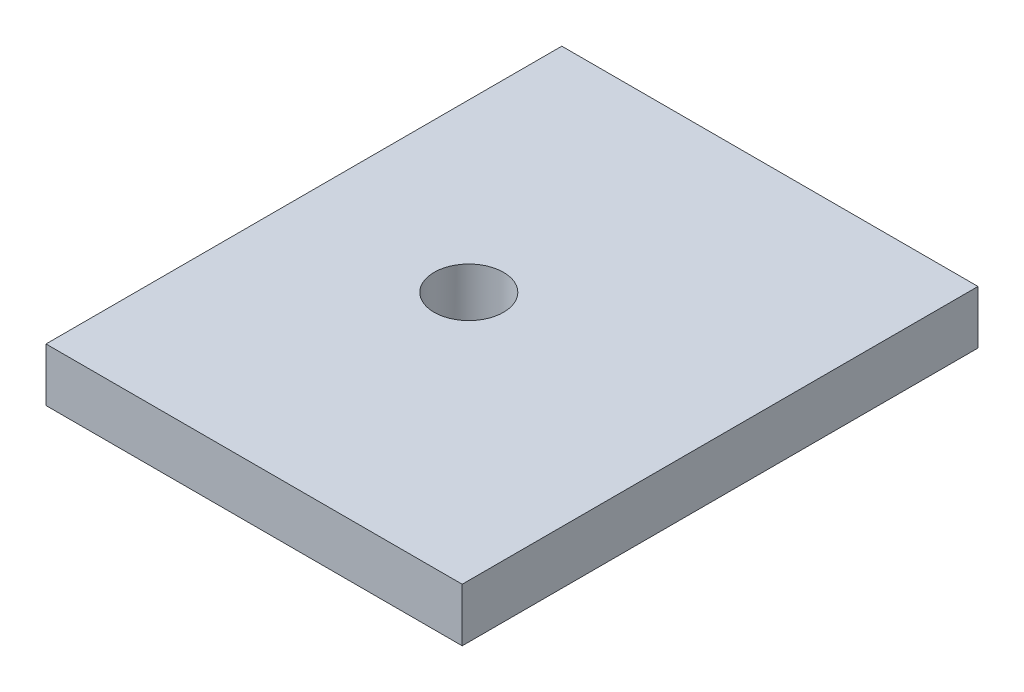
ISO-10303-21;
HEADER;
FILE_DESCRIPTION(('STEP AP214'),'2;1');
FILE_NAME('part.step','',(''),(''),'','','');
FILE_SCHEMA(('AUTOMOTIVE_DESIGN { 1 0 10303 214 1 1 1 1 }'));
ENDSEC;
DATA;
#1=APPLICATION_CONTEXT('core data for automotive mechanical design processes');
#2=APPLICATION_PROTOCOL_DEFINITION('international standard','automotive_design',2000,#1);
#3=PRODUCT_CONTEXT('',#1,'mechanical');
#4=PRODUCT('Part','Part','',(#3));
#5=PRODUCT_RELATED_PRODUCT_CATEGORY('part','',(#4));
#6=PRODUCT_DEFINITION_FORMATION('','',#4);
#7=PRODUCT_DEFINITION_CONTEXT('part definition',#1,'design');
#8=PRODUCT_DEFINITION('design','',#6,#7);
#9=PRODUCT_DEFINITION_SHAPE('','',#8);
#10=(LENGTH_UNIT() NAMED_UNIT(*) SI_UNIT(.MILLI.,.METRE.));
#11=(NAMED_UNIT(*) PLANE_ANGLE_UNIT() SI_UNIT($,.RADIAN.));
#12=(NAMED_UNIT(*) SI_UNIT($,.STERADIAN.) SOLID_ANGLE_UNIT());
#13=UNCERTAINTY_MEASURE_WITH_UNIT(LENGTH_MEASURE(1.E-05),#10,'distance_accuracy_value','');
#14=(GEOMETRIC_REPRESENTATION_CONTEXT(3) GLOBAL_UNCERTAINTY_ASSIGNED_CONTEXT((#13)) GLOBAL_UNIT_ASSIGNED_CONTEXT((#10,
#11,#12)) REPRESENTATION_CONTEXT('',''));
#15=CARTESIAN_POINT('',(0.,0.,0.));
#16=DIRECTION('',(0.,0.,1.));
#17=DIRECTION('',(1.,0.,0.));
#18=AXIS2_PLACEMENT_3D('',#15,#16,#17);
#19=CARTESIAN_POINT('',(0.,3.,0.));
#20=DIRECTION('',(0.,-1.,0.));
#21=DIRECTION('',(0.,0.,-1.));
#22=AXIS2_PLACEMENT_3D('',#19,#20,#21);
#23=PLANE('',#22);
#24=CARTESIAN_POINT('',(-2.32817741662061,3.,0.100000000001585));
#25=DIRECTION('',(0.,1.,0.));
#26=DIRECTION('',(0.,0.,1.));
#27=AXIS2_PLACEMENT_3D('',#24,#25,#26);
#28=CIRCLE('',#27,1.95000000000004);
#29=CARTESIAN_POINT('',(-2.32817741662061,3.,2.05000000000162));
#30=VERTEX_POINT('',#29);
#31=EDGE_CURVE('E113',#30,#30,#28,.T.);
#32=ORIENTED_EDGE('',*,*,#31,.F.);
#33=EDGE_LOOP('',(#32));
#34=FACE_BOUND('',#33,.T.);
#35=DIRECTION('',(0.,0.,-1.));
#36=VECTOR('',#35,1.);
#37=CARTESIAN_POINT('',(11.7,3.,14.5));
#38=LINE('',#37,#36);
#39=CARTESIAN_POINT('',(11.7,3.,14.5));
#40=VERTEX_POINT('',#39);
#41=CARTESIAN_POINT('',(11.7,3.,-14.5));
#42=VERTEX_POINT('',#41);
#43=EDGE_CURVE('E87',#40,#42,#38,.T.);
#44=ORIENTED_EDGE('',*,*,#43,.T.);
#45=DIRECTION('',(-1.,0.,0.));
#46=VECTOR('',#45,1.);
#47=CARTESIAN_POINT('',(-11.7,3.,-14.5));
#48=LINE('',#47,#46);
#49=CARTESIAN_POINT('',(-11.7,3.,-14.5));
#50=VERTEX_POINT('',#49);
#51=EDGE_CURVE('E83',#42,#50,#48,.T.);
#52=ORIENTED_EDGE('',*,*,#51,.T.);
#53=DIRECTION('',(0.,0.,1.));
#54=VECTOR('',#53,1.);
#55=CARTESIAN_POINT('',(-11.7,3.,14.5));
#56=LINE('',#55,#54);
#57=CARTESIAN_POINT('',(-11.7,3.,14.5));
#58=VERTEX_POINT('',#57);
#59=EDGE_CURVE('E85',#50,#58,#56,.T.);
#60=ORIENTED_EDGE('',*,*,#59,.T.);
#61=DIRECTION('',(1.,0.,0.));
#62=VECTOR('',#61,1.);
#63=CARTESIAN_POINT('',(-11.7,3.,14.5));
#64=LINE('',#63,#62);
#65=EDGE_CURVE('E53',#58,#40,#64,.T.);
#66=ORIENTED_EDGE('',*,*,#65,.T.);
#67=EDGE_LOOP('',(#44,#52,#60,#66));
#68=FACE_BOUND('',#67,.T.);
#69=ADVANCED_FACE('F35',(#34,#68),#23,.F.);
#70=CARTESIAN_POINT('',(0.,0.,0.));
#71=DIRECTION('',(0.,-1.,0.));
#72=DIRECTION('',(0.,0.,-1.));
#73=AXIS2_PLACEMENT_3D('',#70,#71,#72);
#74=PLANE('',#73);
#75=CARTESIAN_POINT('',(-2.32817741662061,0.,0.100000000001585));
#76=DIRECTION('',(0.,-1.,0.));
#77=DIRECTION('',(0.,0.,-1.));
#78=AXIS2_PLACEMENT_3D('',#75,#76,#77);
#79=CIRCLE('',#78,1.95000000000004);
#80=CARTESIAN_POINT('',(-2.32817741662061,0.,-1.84999999999845));
#81=VERTEX_POINT('',#80);
#82=EDGE_CURVE('E39',#81,#81,#79,.T.);
#83=ORIENTED_EDGE('',*,*,#82,.F.);
#84=EDGE_LOOP('',(#83));
#85=FACE_BOUND('',#84,.T.);
#86=DIRECTION('',(0.,0.,-1.));
#87=VECTOR('',#86,1.);
#88=CARTESIAN_POINT('',(11.7,0.,14.5));
#89=LINE('',#88,#87);
#90=CARTESIAN_POINT('',(11.7,0.,14.5));
#91=VERTEX_POINT('',#90);
#92=CARTESIAN_POINT('',(11.7,0.,-14.5));
#93=VERTEX_POINT('',#92);
#94=EDGE_CURVE('E100',#91,#93,#89,.T.);
#95=ORIENTED_EDGE('',*,*,#94,.F.);
#96=DIRECTION('',(1.,0.,0.));
#97=VECTOR('',#96,1.);
#98=CARTESIAN_POINT('',(-11.7,0.,14.5));
#99=LINE('',#98,#97);
#100=CARTESIAN_POINT('',(-11.7,0.,14.5));
#101=VERTEX_POINT('',#100);
#102=EDGE_CURVE('E76',#101,#91,#99,.T.);
#103=ORIENTED_EDGE('',*,*,#102,.F.);
#104=DIRECTION('',(0.,0.,1.));
#105=VECTOR('',#104,1.);
#106=CARTESIAN_POINT('',(-11.7,0.,14.5));
#107=LINE('',#106,#105);
#108=CARTESIAN_POINT('',(-11.7,0.,-14.5));
#109=VERTEX_POINT('',#108);
#110=EDGE_CURVE('E70',#109,#101,#107,.T.);
#111=ORIENTED_EDGE('',*,*,#110,.F.);
#112=DIRECTION('',(-1.,0.,0.));
#113=VECTOR('',#112,1.);
#114=CARTESIAN_POINT('',(-11.7,0.,-14.5));
#115=LINE('',#114,#113);
#116=EDGE_CURVE('E91',#93,#109,#115,.T.);
#117=ORIENTED_EDGE('',*,*,#116,.F.);
#118=EDGE_LOOP('',(#95,#103,#111,#117));
#119=FACE_BOUND('',#118,.T.);
#120=ADVANCED_FACE('F110',(#85,#119),#74,.T.);
#121=CARTESIAN_POINT('',(11.7,3.,14.5));
#122=DIRECTION('',(-1.,0.,0.));
#123=DIRECTION('',(0.,0.,1.));
#124=AXIS2_PLACEMENT_3D('',#121,#122,#123);
#125=PLANE('',#124);
#126=ORIENTED_EDGE('',*,*,#94,.T.);
#127=DIRECTION('',(0.,-1.,0.));
#128=VECTOR('',#127,1.);
#129=CARTESIAN_POINT('',(11.7,3.,-14.5));
#130=LINE('',#129,#128);
#131=EDGE_CURVE('E11',#42,#93,#130,.T.);
#132=ORIENTED_EDGE('',*,*,#131,.F.);
#133=ORIENTED_EDGE('',*,*,#43,.F.);
#134=DIRECTION('',(0.,-1.,0.));
#135=VECTOR('',#134,1.);
#136=CARTESIAN_POINT('',(11.7,3.,14.5));
#137=LINE('',#136,#135);
#138=EDGE_CURVE('E96',#40,#91,#137,.T.);
#139=ORIENTED_EDGE('',*,*,#138,.T.);
#140=EDGE_LOOP('',(#126,#132,#133,#139));
#141=FACE_BOUND('',#140,.T.);
#142=ADVANCED_FACE('F37',(#141),#125,.F.);
#143=CARTESIAN_POINT('',(-11.7,3.,-14.5));
#144=DIRECTION('',(0.,0.,1.));
#145=DIRECTION('',(1.,0.,0.));
#146=AXIS2_PLACEMENT_3D('',#143,#144,#145);
#147=PLANE('',#146);
#148=ORIENTED_EDGE('',*,*,#116,.T.);
#149=DIRECTION('',(0.,-1.,0.));
#150=VECTOR('',#149,1.);
#151=CARTESIAN_POINT('',(-11.7,3.,-14.5));
#152=LINE('',#151,#150);
#153=EDGE_CURVE('E45',#50,#109,#152,.T.);
#154=ORIENTED_EDGE('',*,*,#153,.F.);
#155=ORIENTED_EDGE('',*,*,#51,.F.);
#156=ORIENTED_EDGE('',*,*,#131,.T.);
#157=EDGE_LOOP('',(#148,#154,#155,#156));
#158=FACE_BOUND('',#157,.T.);
#159=ADVANCED_FACE('F90',(#158),#147,.F.);
#160=CARTESIAN_POINT('',(-11.7,3.,14.5));
#161=DIRECTION('',(1.,0.,0.));
#162=DIRECTION('',(0.,0.,-1.));
#163=AXIS2_PLACEMENT_3D('',#160,#161,#162);
#164=PLANE('',#163);
#165=ORIENTED_EDGE('',*,*,#110,.T.);
#166=DIRECTION('',(0.,-1.,0.));
#167=VECTOR('',#166,1.);
#168=CARTESIAN_POINT('',(-11.7,3.,14.5));
#169=LINE('',#168,#167);
#170=EDGE_CURVE('E92',#58,#101,#169,.T.);
#171=ORIENTED_EDGE('',*,*,#170,.F.);
#172=ORIENTED_EDGE('',*,*,#59,.F.);
#173=ORIENTED_EDGE('',*,*,#153,.T.);
#174=EDGE_LOOP('',(#165,#171,#172,#173));
#175=FACE_BOUND('',#174,.T.);
#176=ADVANCED_FACE('F94',(#175),#164,.F.);
#177=CARTESIAN_POINT('',(-11.7,3.,14.5));
#178=DIRECTION('',(0.,0.,-1.));
#179=DIRECTION('',(-1.,0.,0.));
#180=AXIS2_PLACEMENT_3D('',#177,#178,#179);
#181=PLANE('',#180);
#182=ORIENTED_EDGE('',*,*,#102,.T.);
#183=ORIENTED_EDGE('',*,*,#138,.F.);
#184=ORIENTED_EDGE('',*,*,#65,.F.);
#185=ORIENTED_EDGE('',*,*,#170,.T.);
#186=EDGE_LOOP('',(#182,#183,#184,#185));
#187=FACE_BOUND('',#186,.T.);
#188=ADVANCED_FACE('F107',(#187),#181,.F.);
#189=CARTESIAN_POINT('',(-2.32817741662061,-7.,0.100000000001585));
#190=DIRECTION('',(0.,1.,0.));
#191=DIRECTION('',(0.,0.,1.));
#192=AXIS2_PLACEMENT_3D('',#189,#190,#191);
#193=CYLINDRICAL_SURFACE('',#192,1.95000000000004);
#194=ORIENTED_EDGE('',*,*,#82,.T.);
#195=EDGE_LOOP('',(#194));
#196=FACE_BOUND('',#195,.T.);
#197=ORIENTED_EDGE('',*,*,#31,.T.);
#198=EDGE_LOOP('',(#197));
#199=FACE_BOUND('',#198,.T.);
#200=ADVANCED_FACE('F120',(#196,#199),#193,.F.);
#201=CLOSED_SHELL('',(#69,#120,#142,#159,#176,#188,#200));
#202=MANIFOLD_SOLID_BREP('B2',#201);
#203=ADVANCED_BREP_SHAPE_REPRESENTATION('',(#18,#202),#14);
#204=SHAPE_DEFINITION_REPRESENTATION(#9,#203);
ENDSEC;
END-ISO-10303-21;
